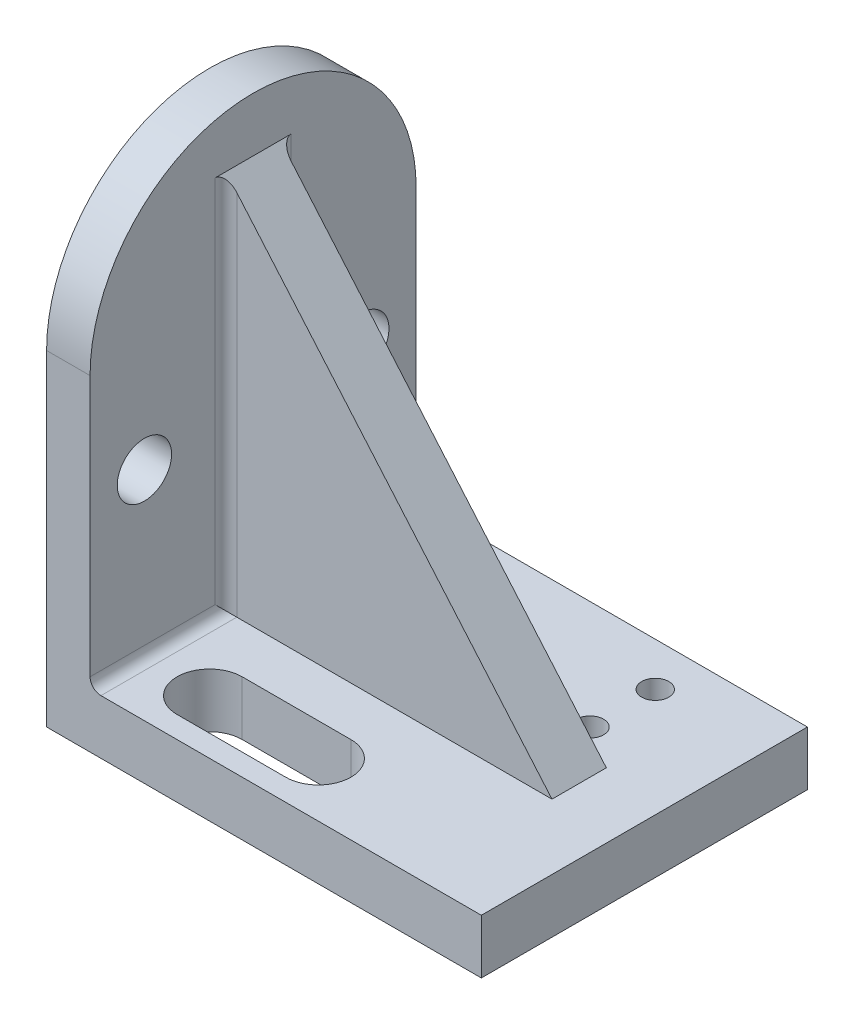
ISO-10303-21;
HEADER;
FILE_DESCRIPTION(('STEP AP214'),'2;1');
FILE_NAME('part.step','',(''),(''),'','','');
FILE_SCHEMA(('AUTOMOTIVE_DESIGN { 1 0 10303 214 1 1 1 1 }'));
ENDSEC;
DATA;
#1=APPLICATION_CONTEXT('core data for automotive mechanical design processes');
#2=APPLICATION_PROTOCOL_DEFINITION('international standard','automotive_design',2000,#1);
#3=PRODUCT_CONTEXT('',#1,'mechanical');
#4=PRODUCT('Part','Part','',(#3));
#5=PRODUCT_RELATED_PRODUCT_CATEGORY('part','',(#4));
#6=PRODUCT_DEFINITION_FORMATION('','',#4);
#7=PRODUCT_DEFINITION_CONTEXT('part definition',#1,'design');
#8=PRODUCT_DEFINITION('design','',#6,#7);
#9=PRODUCT_DEFINITION_SHAPE('','',#8);
#10=(LENGTH_UNIT() NAMED_UNIT(*) SI_UNIT(.MILLI.,.METRE.));
#11=(NAMED_UNIT(*) PLANE_ANGLE_UNIT() SI_UNIT($,.RADIAN.));
#12=(NAMED_UNIT(*) SI_UNIT($,.STERADIAN.) SOLID_ANGLE_UNIT());
#13=UNCERTAINTY_MEASURE_WITH_UNIT(LENGTH_MEASURE(1.E-05),#10,'distance_accuracy_value','');
#14=(GEOMETRIC_REPRESENTATION_CONTEXT(3) GLOBAL_UNCERTAINTY_ASSIGNED_CONTEXT((#13)) GLOBAL_UNIT_ASSIGNED_CONTEXT((#10,
#11,#12)) REPRESENTATION_CONTEXT('',''));
#15=CARTESIAN_POINT('',(0.,0.,0.));
#16=DIRECTION('',(0.,0.,1.));
#17=DIRECTION('',(1.,0.,0.));
#18=AXIS2_PLACEMENT_3D('',#15,#16,#17);
#19=CARTESIAN_POINT('',(-50.8,12.7,38.1));
#20=DIRECTION('',(1.,0.,0.));
#21=DIRECTION('',(0.,0.,-1.));
#22=AXIS2_PLACEMENT_3D('',#19,#20,#21);
#23=PLANE('',#22);
#24=DIRECTION('',(0.,0.,1.));
#25=VECTOR('',#24,1.);
#26=CARTESIAN_POINT('',(-50.8,0.,38.1));
#27=LINE('',#26,#25);
#28=CARTESIAN_POINT('',(-50.8,0.,-38.1));
#29=VERTEX_POINT('',#28);
#30=CARTESIAN_POINT('',(-50.8,0.,38.1));
#31=VERTEX_POINT('',#30);
#32=EDGE_CURVE('E261',#29,#31,#27,.T.);
#33=ORIENTED_EDGE('',*,*,#32,.T.);
#34=DIRECTION('',(0.,-1.,0.));
#35=VECTOR('',#34,1.);
#36=CARTESIAN_POINT('',(-50.8,12.7,38.1));
#37=LINE('',#36,#35);
#38=CARTESIAN_POINT('',(-50.8,76.2,38.1));
#39=VERTEX_POINT('',#38);
#40=EDGE_CURVE('E286',#39,#31,#37,.T.);
#41=ORIENTED_EDGE('',*,*,#40,.F.);
#42=CARTESIAN_POINT('',(-50.8,76.2,0.));
#43=DIRECTION('',(1.,0.,0.));
#44=DIRECTION('',(0.,0.,-1.));
#45=AXIS2_PLACEMENT_3D('',#42,#43,#44);
#46=CIRCLE('',#45,38.1);
#47=CARTESIAN_POINT('',(-50.8,76.2,-38.1));
#48=VERTEX_POINT('',#47);
#49=EDGE_CURVE('E219',#48,#39,#46,.T.);
#50=ORIENTED_EDGE('',*,*,#49,.F.);
#51=DIRECTION('',(0.,-1.,0.));
#52=VECTOR('',#51,1.);
#53=CARTESIAN_POINT('',(-50.8,12.7,-38.1));
#54=LINE('',#53,#52);
#55=EDGE_CURVE('E271',#48,#29,#54,.T.);
#56=ORIENTED_EDGE('',*,*,#55,.T.);
#57=EDGE_LOOP('',(#33,#41,#50,#56));
#58=FACE_BOUND('',#57,.T.);
#59=CARTESIAN_POINT('',(-50.8,50.8,25.4));
#60=DIRECTION('',(1.,0.,0.));
#61=DIRECTION('',(0.,0.,-1.));
#62=AXIS2_PLACEMENT_3D('',#59,#60,#61);
#63=CIRCLE('',#62,6.35);
#64=CARTESIAN_POINT('',(-50.8,50.8,19.05));
#65=VERTEX_POINT('',#64);
#66=EDGE_CURVE('E183',#65,#65,#63,.T.);
#67=ORIENTED_EDGE('',*,*,#66,.T.);
#68=EDGE_LOOP('',(#67));
#69=FACE_BOUND('',#68,.T.);
#70=CARTESIAN_POINT('',(-50.8,50.8,-25.4));
#71=DIRECTION('',(1.,0.,0.));
#72=DIRECTION('',(0.,0.,1.));
#73=AXIS2_PLACEMENT_3D('',#70,#71,#72);
#74=CIRCLE('',#73,6.35);
#75=CARTESIAN_POINT('',(-50.8,50.8,-19.05));
#76=VERTEX_POINT('',#75);
#77=EDGE_CURVE('E176',#76,#76,#74,.T.);
#78=ORIENTED_EDGE('',*,*,#77,.T.);
#79=EDGE_LOOP('',(#78));
#80=FACE_BOUND('',#79,.T.);
#81=ADVANCED_FACE('F37',(#58,#69,#80),#23,.F.);
#82=CARTESIAN_POINT('',(50.8,12.7,38.1));
#83=DIRECTION('',(0.,0.,-1.));
#84=DIRECTION('',(-1.,0.,0.));
#85=AXIS2_PLACEMENT_3D('',#82,#83,#84);
#86=PLANE('',#85);
#87=DIRECTION('',(1.,0.,0.));
#88=VECTOR('',#87,1.);
#89=CARTESIAN_POINT('',(50.8,12.7,38.1));
#90=LINE('',#89,#88);
#91=CARTESIAN_POINT('',(-38.1,12.7,38.1));
#92=VERTEX_POINT('',#91);
#93=CARTESIAN_POINT('',(50.8,12.7,38.1));
#94=VERTEX_POINT('',#93);
#95=EDGE_CURVE('E264',#92,#94,#90,.T.);
#96=ORIENTED_EDGE('',*,*,#95,.F.);
#97=CARTESIAN_POINT('',(-38.1,15.24,38.1));
#98=DIRECTION('',(0.,0.,-1.));
#99=DIRECTION('',(-1.,0.,0.));
#100=AXIS2_PLACEMENT_3D('',#97,#98,#99);
#101=CIRCLE('',#100,2.54);
#102=CARTESIAN_POINT('',(-40.64,15.24,38.1));
#103=VERTEX_POINT('',#102);
#104=EDGE_CURVE('E11',#92,#103,#101,.T.);
#105=ORIENTED_EDGE('',*,*,#104,.T.);
#106=DIRECTION('',(0.,1.,0.));
#107=VECTOR('',#106,1.);
#108=CARTESIAN_POINT('',(-40.64,0.,38.1));
#109=LINE('',#108,#107);
#110=CARTESIAN_POINT('',(-40.64,76.2,38.1));
#111=VERTEX_POINT('',#110);
#112=EDGE_CURVE('E248',#103,#111,#109,.T.);
#113=ORIENTED_EDGE('',*,*,#112,.T.);
#114=DIRECTION('',(-1.,0.,0.));
#115=VECTOR('',#114,1.);
#116=CARTESIAN_POINT('',(-40.64,76.2,38.1));
#117=LINE('',#116,#115);
#118=EDGE_CURVE('E255',#111,#39,#117,.T.);
#119=ORIENTED_EDGE('',*,*,#118,.T.);
#120=ORIENTED_EDGE('',*,*,#40,.T.);
#121=DIRECTION('',(1.,0.,0.));
#122=VECTOR('',#121,1.);
#123=CARTESIAN_POINT('',(50.8,0.,38.1));
#124=LINE('',#123,#122);
#125=CARTESIAN_POINT('',(50.8,0.,38.1));
#126=VERTEX_POINT('',#125);
#127=EDGE_CURVE('E273',#31,#126,#124,.T.);
#128=ORIENTED_EDGE('',*,*,#127,.T.);
#129=DIRECTION('',(0.,-1.,0.));
#130=VECTOR('',#129,1.);
#131=CARTESIAN_POINT('',(50.8,12.7,38.1));
#132=LINE('',#131,#130);
#133=EDGE_CURVE('E283',#94,#126,#132,.T.);
#134=ORIENTED_EDGE('',*,*,#133,.F.);
#135=EDGE_LOOP('',(#96,#105,#113,#119,#120,#128,#134));
#136=FACE_BOUND('',#135,.T.);
#137=ADVANCED_FACE('F339',(#136),#86,.F.);
#138=CARTESIAN_POINT('',(50.8,12.7,38.1));
#139=DIRECTION('',(-1.,0.,0.));
#140=DIRECTION('',(0.,0.,1.));
#141=AXIS2_PLACEMENT_3D('',#138,#139,#140);
#142=PLANE('',#141);
#143=DIRECTION('',(0.,0.,-1.));
#144=VECTOR('',#143,1.);
#145=CARTESIAN_POINT('',(50.8,0.,38.1));
#146=LINE('',#145,#144);
#147=CARTESIAN_POINT('',(50.8,0.,-38.1));
#148=VERTEX_POINT('',#147);
#149=EDGE_CURVE('E275',#126,#148,#146,.T.);
#150=ORIENTED_EDGE('',*,*,#149,.T.);
#151=DIRECTION('',(0.,-1.,0.));
#152=VECTOR('',#151,1.);
#153=CARTESIAN_POINT('',(50.8,12.7,-38.1));
#154=LINE('',#153,#152);
#155=CARTESIAN_POINT('',(50.8,12.7,-38.1));
#156=VERTEX_POINT('',#155);
#157=EDGE_CURVE('E280',#156,#148,#154,.T.);
#158=ORIENTED_EDGE('',*,*,#157,.F.);
#159=DIRECTION('',(0.,0.,-1.));
#160=VECTOR('',#159,1.);
#161=CARTESIAN_POINT('',(50.8,12.7,38.1));
#162=LINE('',#161,#160);
#163=EDGE_CURVE('E266',#94,#156,#162,.T.);
#164=ORIENTED_EDGE('',*,*,#163,.F.);
#165=ORIENTED_EDGE('',*,*,#133,.T.);
#166=EDGE_LOOP('',(#150,#158,#164,#165));
#167=FACE_BOUND('',#166,.T.);
#168=ADVANCED_FACE('F345',(#167),#142,.F.);
#169=CARTESIAN_POINT('',(50.8,12.7,-38.1));
#170=DIRECTION('',(0.,0.,1.));
#171=DIRECTION('',(1.,0.,0.));
#172=AXIS2_PLACEMENT_3D('',#169,#170,#171);
#173=PLANE('',#172);
#174=DIRECTION('',(-1.,0.,0.));
#175=VECTOR('',#174,1.);
#176=CARTESIAN_POINT('',(50.8,0.,-38.1));
#177=LINE('',#176,#175);
#178=EDGE_CURVE('E267',#148,#29,#177,.T.);
#179=ORIENTED_EDGE('',*,*,#178,.T.);
#180=ORIENTED_EDGE('',*,*,#55,.F.);
#181=DIRECTION('',(-1.,0.,0.));
#182=VECTOR('',#181,1.);
#183=CARTESIAN_POINT('',(-40.64,76.2,-38.1));
#184=LINE('',#183,#182);
#185=CARTESIAN_POINT('',(-40.64,76.2,-38.1));
#186=VERTEX_POINT('',#185);
#187=EDGE_CURVE('E258',#186,#48,#184,.T.);
#188=ORIENTED_EDGE('',*,*,#187,.F.);
#189=DIRECTION('',(0.,1.,0.));
#190=VECTOR('',#189,1.);
#191=CARTESIAN_POINT('',(-40.64,0.,-38.1));
#192=LINE('',#191,#190);
#193=CARTESIAN_POINT('',(-40.64,15.24,-38.1));
#194=VERTEX_POINT('',#193);
#195=EDGE_CURVE('E253',#194,#186,#192,.T.);
#196=ORIENTED_EDGE('',*,*,#195,.F.);
#197=CARTESIAN_POINT('',(-38.1,15.24,-38.1));
#198=DIRECTION('',(0.,0.,1.));
#199=DIRECTION('',(1.,0.,0.));
#200=AXIS2_PLACEMENT_3D('',#197,#198,#199);
#201=CIRCLE('',#200,2.54);
#202=CARTESIAN_POINT('',(-38.1,12.7,-38.1));
#203=VERTEX_POINT('',#202);
#204=EDGE_CURVE('E61',#194,#203,#201,.T.);
#205=ORIENTED_EDGE('',*,*,#204,.T.);
#206=DIRECTION('',(-1.,0.,0.));
#207=VECTOR('',#206,1.);
#208=CARTESIAN_POINT('',(50.8,12.7,-38.1));
#209=LINE('',#208,#207);
#210=EDGE_CURVE('E269',#156,#203,#209,.T.);
#211=ORIENTED_EDGE('',*,*,#210,.F.);
#212=ORIENTED_EDGE('',*,*,#157,.T.);
#213=EDGE_LOOP('',(#179,#180,#188,#196,#205,#211,#212));
#214=FACE_BOUND('',#213,.T.);
#215=ADVANCED_FACE('F416',(#214),#173,.F.);
#216=CARTESIAN_POINT('',(0.,12.7,0.));
#217=DIRECTION('',(0.,1.,0.));
#218=DIRECTION('',(0.,0.,1.));
#219=AXIS2_PLACEMENT_3D('',#216,#217,#218);
#220=PLANE('',#219);
#221=ORIENTED_EDGE('',*,*,#210,.T.);
#222=DIRECTION('',(0.,0.,-1.));
#223=VECTOR('',#222,1.);
#224=CARTESIAN_POINT('',(-38.1,12.7,-6.35));
#225=LINE('',#224,#223);
#226=CARTESIAN_POINT('',(-38.1,12.7,-6.35));
#227=VERTEX_POINT('',#226);
#228=EDGE_CURVE('E171',#203,#227,#225,.F.);
#229=ORIENTED_EDGE('',*,*,#228,.T.);
#230=DIRECTION('',(1.,0.,0.));
#231=VECTOR('',#230,1.);
#232=CARTESIAN_POINT('',(0.,12.7,-6.35));
#233=LINE('',#232,#231);
#234=CARTESIAN_POINT('',(35.56,12.7,-6.35));
#235=VERTEX_POINT('',#234);
#236=EDGE_CURVE('E155',#227,#235,#233,.T.);
#237=ORIENTED_EDGE('',*,*,#236,.T.);
#238=DIRECTION('',(0.,0.,1.));
#239=VECTOR('',#238,1.);
#240=CARTESIAN_POINT('',(35.56,12.7,0.));
#241=LINE('',#240,#239);
#242=CARTESIAN_POINT('',(35.56,12.7,6.35));
#243=VERTEX_POINT('',#242);
#244=EDGE_CURVE('E169',#243,#235,#241,.F.);
#245=ORIENTED_EDGE('',*,*,#244,.F.);
#246=DIRECTION('',(1.,0.,0.));
#247=VECTOR('',#246,1.);
#248=CARTESIAN_POINT('',(0.,12.7,6.35));
#249=LINE('',#248,#247);
#250=CARTESIAN_POINT('',(-38.1,12.7,6.35));
#251=VERTEX_POINT('',#250);
#252=EDGE_CURVE('E172',#251,#243,#249,.T.);
#253=ORIENTED_EDGE('',*,*,#252,.F.);
#254=DIRECTION('',(0.,0.,-1.));
#255=VECTOR('',#254,1.);
#256=CARTESIAN_POINT('',(-38.1,12.7,38.1));
#257=LINE('',#256,#255);
#258=EDGE_CURVE('E302',#251,#92,#257,.F.);
#259=ORIENTED_EDGE('',*,*,#258,.T.);
#260=ORIENTED_EDGE('',*,*,#95,.T.);
#261=ORIENTED_EDGE('',*,*,#163,.T.);
#262=EDGE_LOOP('',(#221,#229,#237,#245,#253,#259,#260,#261));
#263=FACE_BOUND('',#262,.T.);
#264=CARTESIAN_POINT('',(-25.4,12.7,25.4));
#265=DIRECTION('',(0.,1.,0.));
#266=DIRECTION('',(0.,0.,1.));
#267=AXIS2_PLACEMENT_3D('',#264,#265,#266);
#268=CIRCLE('',#267,7.62);
#269=CARTESIAN_POINT('',(-25.4,12.7,17.78));
#270=VERTEX_POINT('',#269);
#271=CARTESIAN_POINT('',(-25.4,12.7,33.02));
#272=VERTEX_POINT('',#271);
#273=EDGE_CURVE('E206',#270,#272,#268,.T.);
#274=ORIENTED_EDGE('',*,*,#273,.F.);
#275=DIRECTION('',(-1.,0.,0.));
#276=VECTOR('',#275,1.);
#277=CARTESIAN_POINT('',(-25.4,12.7,17.78));
#278=LINE('',#277,#276);
#279=CARTESIAN_POINT('',(0.,12.7,17.78));
#280=VERTEX_POINT('',#279);
#281=EDGE_CURVE('E196',#280,#270,#278,.T.);
#282=ORIENTED_EDGE('',*,*,#281,.F.);
#283=CARTESIAN_POINT('',(0.,12.7,25.4));
#284=DIRECTION('',(0.,1.,0.));
#285=DIRECTION('',(0.,0.,1.));
#286=AXIS2_PLACEMENT_3D('',#283,#284,#285);
#287=CIRCLE('',#286,7.62);
#288=CARTESIAN_POINT('',(0.,12.7,33.02));
#289=VERTEX_POINT('',#288);
#290=EDGE_CURVE('E212',#289,#280,#287,.T.);
#291=ORIENTED_EDGE('',*,*,#290,.F.);
#292=DIRECTION('',(1.,0.,0.));
#293=VECTOR('',#292,1.);
#294=CARTESIAN_POINT('',(-25.4,12.7,33.02));
#295=LINE('',#294,#293);
#296=EDGE_CURVE('E208',#272,#289,#295,.T.);
#297=ORIENTED_EDGE('',*,*,#296,.F.);
#298=EDGE_LOOP('',(#274,#282,#291,#297));
#299=FACE_BOUND('',#298,.T.);
#300=CARTESIAN_POINT('',(-25.4,12.7,-27.94));
#301=DIRECTION('',(0.,1.,0.));
#302=DIRECTION('',(0.,0.,1.));
#303=AXIS2_PLACEMENT_3D('',#300,#301,#302);
#304=CIRCLE('',#303,3.175);
#305=CARTESIAN_POINT('',(-25.4,12.7,-24.765));
#306=VERTEX_POINT('',#305);
#307=EDGE_CURVE('E228',#306,#306,#304,.T.);
#308=ORIENTED_EDGE('',*,*,#307,.F.);
#309=EDGE_LOOP('',(#308));
#310=FACE_BOUND('',#309,.T.);
#311=CARTESIAN_POINT('',(25.4,12.7,-27.94));
#312=DIRECTION('',(0.,1.,0.));
#313=DIRECTION('',(0.,0.,1.));
#314=AXIS2_PLACEMENT_3D('',#311,#312,#313);
#315=CIRCLE('',#314,3.175);
#316=CARTESIAN_POINT('',(25.4,12.7,-24.765));
#317=VERTEX_POINT('',#316);
#318=EDGE_CURVE('E234',#317,#317,#315,.T.);
#319=ORIENTED_EDGE('',*,*,#318,.F.);
#320=EDGE_LOOP('',(#319));
#321=FACE_BOUND('',#320,.T.);
#322=CARTESIAN_POINT('',(25.4,12.7,-12.7));
#323=DIRECTION('',(0.,1.,0.));
#324=DIRECTION('',(0.,0.,1.));
#325=AXIS2_PLACEMENT_3D('',#322,#323,#324);
#326=CIRCLE('',#325,3.175);
#327=CARTESIAN_POINT('',(25.4,12.7,-9.52500000000001));
#328=VERTEX_POINT('',#327);
#329=EDGE_CURVE('E240',#328,#328,#326,.T.);
#330=ORIENTED_EDGE('',*,*,#329,.F.);
#331=EDGE_LOOP('',(#330));
#332=FACE_BOUND('',#331,.T.);
#333=CARTESIAN_POINT('',(-25.4,12.7,-12.7));
#334=DIRECTION('',(0.,1.,0.));
#335=DIRECTION('',(0.,0.,1.));
#336=AXIS2_PLACEMENT_3D('',#333,#334,#335);
#337=CIRCLE('',#336,3.175);
#338=CARTESIAN_POINT('',(-25.4,12.7,-9.52500000000001));
#339=VERTEX_POINT('',#338);
#340=EDGE_CURVE('E186',#339,#339,#337,.T.);
#341=ORIENTED_EDGE('',*,*,#340,.F.);
#342=EDGE_LOOP('',(#341));
#343=FACE_BOUND('',#342,.T.);
#344=ADVANCED_FACE('F166',(#263,#299,#310,#321,#332,#343),#220,.T.);
#345=CARTESIAN_POINT('',(0.,0.,0.));
#346=DIRECTION('',(0.,1.,0.));
#347=DIRECTION('',(0.,0.,1.));
#348=AXIS2_PLACEMENT_3D('',#345,#346,#347);
#349=PLANE('',#348);
#350=DIRECTION('',(-1.,0.,0.));
#351=VECTOR('',#350,1.);
#352=CARTESIAN_POINT('',(-25.4,0.,17.78));
#353=LINE('',#352,#351);
#354=CARTESIAN_POINT('',(0.,0.,17.78));
#355=VERTEX_POINT('',#354);
#356=CARTESIAN_POINT('',(-25.4,0.,17.78));
#357=VERTEX_POINT('',#356);
#358=EDGE_CURVE('E202',#355,#357,#353,.T.);
#359=ORIENTED_EDGE('',*,*,#358,.T.);
#360=CARTESIAN_POINT('',(-25.4,0.,25.4));
#361=DIRECTION('',(0.,1.,0.));
#362=DIRECTION('',(0.,0.,1.));
#363=AXIS2_PLACEMENT_3D('',#360,#361,#362);
#364=CIRCLE('',#363,7.62);
#365=CARTESIAN_POINT('',(-25.4,0.,33.02));
#366=VERTEX_POINT('',#365);
#367=EDGE_CURVE('E192',#357,#366,#364,.T.);
#368=ORIENTED_EDGE('',*,*,#367,.T.);
#369=DIRECTION('',(1.,0.,0.));
#370=VECTOR('',#369,1.);
#371=CARTESIAN_POINT('',(-25.4,0.,33.02));
#372=LINE('',#371,#370);
#373=CARTESIAN_POINT('',(0.,0.,33.02));
#374=VERTEX_POINT('',#373);
#375=EDGE_CURVE('E195',#366,#374,#372,.T.);
#376=ORIENTED_EDGE('',*,*,#375,.T.);
#377=CARTESIAN_POINT('',(0.,0.,25.4));
#378=DIRECTION('',(0.,1.,0.));
#379=DIRECTION('',(0.,0.,1.));
#380=AXIS2_PLACEMENT_3D('',#377,#378,#379);
#381=CIRCLE('',#380,7.62);
#382=EDGE_CURVE('E199',#374,#355,#381,.T.);
#383=ORIENTED_EDGE('',*,*,#382,.T.);
#384=EDGE_LOOP('',(#359,#368,#376,#383));
#385=FACE_BOUND('',#384,.T.);
#386=CARTESIAN_POINT('',(-25.4,0.,-27.94));
#387=DIRECTION('',(0.,1.,0.));
#388=DIRECTION('',(0.,0.,1.));
#389=AXIS2_PLACEMENT_3D('',#386,#387,#388);
#390=CIRCLE('',#389,3.175);
#391=CARTESIAN_POINT('',(-25.4,0.,-24.765));
#392=VERTEX_POINT('',#391);
#393=EDGE_CURVE('E209',#392,#392,#390,.T.);
#394=ORIENTED_EDGE('',*,*,#393,.T.);
#395=EDGE_LOOP('',(#394));
#396=FACE_BOUND('',#395,.T.);
#397=CARTESIAN_POINT('',(25.4,0.,-27.94));
#398=DIRECTION('',(0.,1.,0.));
#399=DIRECTION('',(0.,0.,1.));
#400=AXIS2_PLACEMENT_3D('',#397,#398,#399);
#401=CIRCLE('',#400,3.175);
#402=CARTESIAN_POINT('',(25.4,0.,-24.765));
#403=VERTEX_POINT('',#402);
#404=EDGE_CURVE('E231',#403,#403,#401,.T.);
#405=ORIENTED_EDGE('',*,*,#404,.T.);
#406=EDGE_LOOP('',(#405));
#407=FACE_BOUND('',#406,.T.);
#408=CARTESIAN_POINT('',(25.4,0.,-12.7));
#409=DIRECTION('',(0.,1.,0.));
#410=DIRECTION('',(0.,0.,1.));
#411=AXIS2_PLACEMENT_3D('',#408,#409,#410);
#412=CIRCLE('',#411,3.175);
#413=CARTESIAN_POINT('',(25.4,0.,-9.52500000000001));
#414=VERTEX_POINT('',#413);
#415=EDGE_CURVE('E237',#414,#414,#412,.T.);
#416=ORIENTED_EDGE('',*,*,#415,.T.);
#417=EDGE_LOOP('',(#416));
#418=FACE_BOUND('',#417,.T.);
#419=CARTESIAN_POINT('',(-25.4,0.,-12.7));
#420=DIRECTION('',(0.,1.,0.));
#421=DIRECTION('',(0.,0.,1.));
#422=AXIS2_PLACEMENT_3D('',#419,#420,#421);
#423=CIRCLE('',#422,3.175);
#424=CARTESIAN_POINT('',(-25.4,0.,-9.52500000000001));
#425=VERTEX_POINT('',#424);
#426=EDGE_CURVE('E243',#425,#425,#423,.T.);
#427=ORIENTED_EDGE('',*,*,#426,.T.);
#428=EDGE_LOOP('',(#427));
#429=FACE_BOUND('',#428,.T.);
#430=ORIENTED_EDGE('',*,*,#127,.F.);
#431=ORIENTED_EDGE('',*,*,#32,.F.);
#432=ORIENTED_EDGE('',*,*,#178,.F.);
#433=ORIENTED_EDGE('',*,*,#149,.F.);
#434=EDGE_LOOP('',(#430,#431,#432,#433));
#435=FACE_BOUND('',#434,.T.);
#436=ADVANCED_FACE('F415',(#385,#396,#407,#418,#429,#435),#349,.F.);
#437=CARTESIAN_POINT('',(-40.64,76.2,0.));
#438=DIRECTION('',(-1.,0.,0.));
#439=DIRECTION('',(0.,0.,1.));
#440=AXIS2_PLACEMENT_3D('',#437,#438,#439);
#441=CYLINDRICAL_SURFACE('',#440,38.1);
#442=ORIENTED_EDGE('',*,*,#49,.T.);
#443=ORIENTED_EDGE('',*,*,#118,.F.);
#444=CARTESIAN_POINT('',(-40.64,76.2,0.));
#445=DIRECTION('',(1.,0.,0.));
#446=DIRECTION('',(0.,0.,-1.));
#447=AXIS2_PLACEMENT_3D('',#444,#445,#446);
#448=CIRCLE('',#447,38.1);
#449=EDGE_CURVE('E250',#186,#111,#448,.T.);
#450=ORIENTED_EDGE('',*,*,#449,.F.);
#451=ORIENTED_EDGE('',*,*,#187,.T.);
#452=EDGE_LOOP('',(#442,#443,#450,#451));
#453=FACE_BOUND('',#452,.T.);
#454=ADVANCED_FACE('F400',(#453),#441,.T.);
#455=CARTESIAN_POINT('',(-40.64,76.2,0.));
#456=DIRECTION('',(1.,0.,0.));
#457=DIRECTION('',(0.,0.,-1.));
#458=AXIS2_PLACEMENT_3D('',#455,#456,#457);
#459=PLANE('',#458);
#460=DIRECTION('',(0.,0.,-1.));
#461=VECTOR('',#460,1.);
#462=CARTESIAN_POINT('',(-40.64,101.6,0.));
#463=LINE('',#462,#461);
#464=CARTESIAN_POINT('',(-40.64,101.6,-8.89));
#465=VERTEX_POINT('',#464);
#466=CARTESIAN_POINT('',(-40.64,101.6,8.89));
#467=VERTEX_POINT('',#466);
#468=EDGE_CURVE('E289',#465,#467,#463,.F.);
#469=ORIENTED_EDGE('',*,*,#468,.F.);
#470=DIRECTION('',(0.,-1.,0.));
#471=VECTOR('',#470,1.);
#472=CARTESIAN_POINT('',(-40.64,76.2,-8.89));
#473=LINE('',#472,#471);
#474=CARTESIAN_POINT('',(-40.64,15.24,-8.89));
#475=VERTEX_POINT('',#474);
#476=EDGE_CURVE('E298',#465,#475,#473,.T.);
#477=ORIENTED_EDGE('',*,*,#476,.T.);
#478=DIRECTION('',(0.,0.,-1.));
#479=VECTOR('',#478,1.);
#480=CARTESIAN_POINT('',(-40.64,15.24,-38.1));
#481=LINE('',#480,#479);
#482=EDGE_CURVE('E296',#475,#194,#481,.T.);
#483=ORIENTED_EDGE('',*,*,#482,.T.);
#484=ORIENTED_EDGE('',*,*,#195,.T.);
#485=ORIENTED_EDGE('',*,*,#449,.T.);
#486=ORIENTED_EDGE('',*,*,#112,.F.);
#487=DIRECTION('',(0.,0.,-1.));
#488=VECTOR('',#487,1.);
#489=CARTESIAN_POINT('',(-40.64,15.24,6.35));
#490=LINE('',#489,#488);
#491=CARTESIAN_POINT('',(-40.64,15.24,8.89));
#492=VERTEX_POINT('',#491);
#493=EDGE_CURVE('E291',#103,#492,#490,.T.);
#494=ORIENTED_EDGE('',*,*,#493,.T.);
#495=DIRECTION('',(0.,-1.,0.));
#496=VECTOR('',#495,1.);
#497=CARTESIAN_POINT('',(-40.64,101.6,8.89));
#498=LINE('',#497,#496);
#499=EDGE_CURVE('E293',#492,#467,#498,.F.);
#500=ORIENTED_EDGE('',*,*,#499,.T.);
#501=EDGE_LOOP('',(#469,#477,#483,#484,#485,#486,#494,#500));
#502=FACE_BOUND('',#501,.T.);
#503=CARTESIAN_POINT('',(-40.64,50.8,25.4));
#504=DIRECTION('',(1.,0.,0.));
#505=DIRECTION('',(0.,0.,-1.));
#506=AXIS2_PLACEMENT_3D('',#503,#504,#505);
#507=CIRCLE('',#506,6.35);
#508=CARTESIAN_POINT('',(-40.64,50.8,19.05));
#509=VERTEX_POINT('',#508);
#510=EDGE_CURVE('E187',#509,#509,#507,.T.);
#511=ORIENTED_EDGE('',*,*,#510,.F.);
#512=EDGE_LOOP('',(#511));
#513=FACE_BOUND('',#512,.T.);
#514=CARTESIAN_POINT('',(-40.64,50.8,-25.4));
#515=DIRECTION('',(1.,0.,0.));
#516=DIRECTION('',(0.,0.,1.));
#517=AXIS2_PLACEMENT_3D('',#514,#515,#516);
#518=CIRCLE('',#517,6.35);
#519=CARTESIAN_POINT('',(-40.64,50.8,-19.05));
#520=VERTEX_POINT('',#519);
#521=EDGE_CURVE('E179',#520,#520,#518,.T.);
#522=ORIENTED_EDGE('',*,*,#521,.F.);
#523=EDGE_LOOP('',(#522));
#524=FACE_BOUND('',#523,.T.);
#525=ADVANCED_FACE('F394',(#502,#513,#524),#459,.T.);
#526=CARTESIAN_POINT('',(-25.4,0.,-12.7));
#527=DIRECTION('',(0.,1.,0.));
#528=DIRECTION('',(0.,0.,1.));
#529=AXIS2_PLACEMENT_3D('',#526,#527,#528);
#530=CYLINDRICAL_SURFACE('',#529,3.175);
#531=ORIENTED_EDGE('',*,*,#426,.F.);
#532=EDGE_LOOP('',(#531));
#533=FACE_BOUND('',#532,.T.);
#534=ORIENTED_EDGE('',*,*,#340,.T.);
#535=EDGE_LOOP('',(#534));
#536=FACE_BOUND('',#535,.T.);
#537=ADVANCED_FACE('F399',(#533,#536),#530,.F.);
#538=CARTESIAN_POINT('',(25.4,0.,-12.7));
#539=DIRECTION('',(0.,1.,0.));
#540=DIRECTION('',(0.,0.,1.));
#541=AXIS2_PLACEMENT_3D('',#538,#539,#540);
#542=CYLINDRICAL_SURFACE('',#541,3.175);
#543=ORIENTED_EDGE('',*,*,#415,.F.);
#544=EDGE_LOOP('',(#543));
#545=FACE_BOUND('',#544,.T.);
#546=ORIENTED_EDGE('',*,*,#329,.T.);
#547=EDGE_LOOP('',(#546));
#548=FACE_BOUND('',#547,.T.);
#549=ADVANCED_FACE('F533',(#545,#548),#542,.F.);
#550=CARTESIAN_POINT('',(25.4,0.,-27.94));
#551=DIRECTION('',(0.,1.,0.));
#552=DIRECTION('',(0.,0.,1.));
#553=AXIS2_PLACEMENT_3D('',#550,#551,#552);
#554=CYLINDRICAL_SURFACE('',#553,3.175);
#555=ORIENTED_EDGE('',*,*,#404,.F.);
#556=EDGE_LOOP('',(#555));
#557=FACE_BOUND('',#556,.T.);
#558=ORIENTED_EDGE('',*,*,#318,.T.);
#559=EDGE_LOOP('',(#558));
#560=FACE_BOUND('',#559,.T.);
#561=ADVANCED_FACE('F522',(#557,#560),#554,.F.);
#562=CARTESIAN_POINT('',(-25.4,0.,-27.94));
#563=DIRECTION('',(0.,1.,0.));
#564=DIRECTION('',(0.,0.,1.));
#565=AXIS2_PLACEMENT_3D('',#562,#563,#564);
#566=CYLINDRICAL_SURFACE('',#565,3.175);
#567=ORIENTED_EDGE('',*,*,#393,.F.);
#568=EDGE_LOOP('',(#567));
#569=FACE_BOUND('',#568,.T.);
#570=ORIENTED_EDGE('',*,*,#307,.T.);
#571=EDGE_LOOP('',(#570));
#572=FACE_BOUND('',#571,.T.);
#573=ADVANCED_FACE('F511',(#569,#572),#566,.F.);
#574=CARTESIAN_POINT('',(-25.4,0.,25.4));
#575=DIRECTION('',(0.,1.,0.));
#576=DIRECTION('',(0.,0.,1.));
#577=AXIS2_PLACEMENT_3D('',#574,#575,#576);
#578=CYLINDRICAL_SURFACE('',#577,7.62);
#579=ORIENTED_EDGE('',*,*,#273,.T.);
#580=DIRECTION('',(0.,1.,0.));
#581=VECTOR('',#580,1.);
#582=CARTESIAN_POINT('',(-25.4,0.,33.02));
#583=LINE('',#582,#581);
#584=EDGE_CURVE('E205',#366,#272,#583,.T.);
#585=ORIENTED_EDGE('',*,*,#584,.F.);
#586=ORIENTED_EDGE('',*,*,#367,.F.);
#587=DIRECTION('',(0.,1.,0.));
#588=VECTOR('',#587,1.);
#589=CARTESIAN_POINT('',(-25.4,0.,17.78));
#590=LINE('',#589,#588);
#591=EDGE_CURVE('E217',#357,#270,#590,.T.);
#592=ORIENTED_EDGE('',*,*,#591,.T.);
#593=EDGE_LOOP('',(#579,#585,#586,#592));
#594=FACE_BOUND('',#593,.T.);
#595=ADVANCED_FACE('F500',(#594),#578,.F.);
#596=CARTESIAN_POINT('',(-25.4,0.,17.78));
#597=DIRECTION('',(0.,0.,-1.));
#598=DIRECTION('',(-1.,0.,0.));
#599=AXIS2_PLACEMENT_3D('',#596,#597,#598);
#600=PLANE('',#599);
#601=ORIENTED_EDGE('',*,*,#281,.T.);
#602=ORIENTED_EDGE('',*,*,#591,.F.);
#603=ORIENTED_EDGE('',*,*,#358,.F.);
#604=DIRECTION('',(0.,1.,0.));
#605=VECTOR('',#604,1.);
#606=CARTESIAN_POINT('',(0.,0.,17.78));
#607=LINE('',#606,#605);
#608=EDGE_CURVE('E220',#355,#280,#607,.T.);
#609=ORIENTED_EDGE('',*,*,#608,.T.);
#610=EDGE_LOOP('',(#601,#602,#603,#609));
#611=FACE_BOUND('',#610,.T.);
#612=ADVANCED_FACE('F489',(#611),#600,.F.);
#613=CARTESIAN_POINT('',(0.,0.,25.4));
#614=DIRECTION('',(0.,1.,0.));
#615=DIRECTION('',(0.,0.,1.));
#616=AXIS2_PLACEMENT_3D('',#613,#614,#615);
#617=CYLINDRICAL_SURFACE('',#616,7.62);
#618=ORIENTED_EDGE('',*,*,#290,.T.);
#619=ORIENTED_EDGE('',*,*,#608,.F.);
#620=ORIENTED_EDGE('',*,*,#382,.F.);
#621=DIRECTION('',(0.,1.,0.));
#622=VECTOR('',#621,1.);
#623=CARTESIAN_POINT('',(0.,0.,33.02));
#624=LINE('',#623,#622);
#625=EDGE_CURVE('E222',#374,#289,#624,.T.);
#626=ORIENTED_EDGE('',*,*,#625,.T.);
#627=EDGE_LOOP('',(#618,#619,#620,#626));
#628=FACE_BOUND('',#627,.T.);
#629=ADVANCED_FACE('F478',(#628),#617,.F.);
#630=CARTESIAN_POINT('',(-25.4,0.,33.02));
#631=DIRECTION('',(0.,0.,1.));
#632=DIRECTION('',(1.,0.,0.));
#633=AXIS2_PLACEMENT_3D('',#630,#631,#632);
#634=PLANE('',#633);
#635=ORIENTED_EDGE('',*,*,#296,.T.);
#636=ORIENTED_EDGE('',*,*,#625,.F.);
#637=ORIENTED_EDGE('',*,*,#375,.F.);
#638=ORIENTED_EDGE('',*,*,#584,.T.);
#639=EDGE_LOOP('',(#635,#636,#637,#638));
#640=FACE_BOUND('',#639,.T.);
#641=ADVANCED_FACE('F467',(#640),#634,.F.);
#642=CARTESIAN_POINT('',(-50.8,50.8,-25.4));
#643=DIRECTION('',(1.,0.,0.));
#644=DIRECTION('',(0.,0.,-1.));
#645=AXIS2_PLACEMENT_3D('',#642,#643,#644);
#646=CYLINDRICAL_SURFACE('',#645,6.35);
#647=ORIENTED_EDGE('',*,*,#77,.F.);
#648=EDGE_LOOP('',(#647));
#649=FACE_BOUND('',#648,.T.);
#650=ORIENTED_EDGE('',*,*,#521,.T.);
#651=EDGE_LOOP('',(#650));
#652=FACE_BOUND('',#651,.T.);
#653=ADVANCED_FACE('F456',(#649,#652),#646,.F.);
#654=CARTESIAN_POINT('',(-50.8,50.8,25.4));
#655=DIRECTION('',(1.,0.,0.));
#656=DIRECTION('',(0.,0.,-1.));
#657=AXIS2_PLACEMENT_3D('',#654,#655,#656);
#658=CYLINDRICAL_SURFACE('',#657,6.35);
#659=ORIENTED_EDGE('',*,*,#66,.F.);
#660=EDGE_LOOP('',(#659));
#661=FACE_BOUND('',#660,.T.);
#662=ORIENTED_EDGE('',*,*,#510,.T.);
#663=EDGE_LOOP('',(#662));
#664=FACE_BOUND('',#663,.T.);
#665=ADVANCED_FACE('F336',(#661,#664),#658,.F.);
#666=CARTESIAN_POINT('',(-40.64,101.6,0.));
#667=DIRECTION('',(-0.759256602365297,-0.650791373455969,0.));
#668=DIRECTION('',(0.650791373455969,-0.759256602365297,0.));
#669=AXIS2_PLACEMENT_3D('',#666,#667,#668);
#670=PLANE('',#669);
#671=ORIENTED_EDGE('',*,*,#468,.T.);
#672=CARTESIAN_POINT('',(-38.1,98.6366666666667,8.89));
#673=DIRECTION('',(-0.759256602365297,-0.650791373455969,0.));
#674=DIRECTION('',(-0.650791373455969,0.759256602365297,0.));
#675=AXIS2_PLACEMENT_3D('',#672,#673,#674);
#676=ELLIPSE('',#675,3.90294048692066,2.54);
#677=CARTESIAN_POINT('',(-38.1,98.6366666666667,6.35));
#678=VERTEX_POINT('',#677);
#679=EDGE_CURVE('E46',#467,#678,#676,.T.);
#680=ORIENTED_EDGE('',*,*,#679,.T.);
#681=DIRECTION('',(0.650791373455969,-0.759256602365297,0.));
#682=VECTOR('',#681,1.);
#683=CARTESIAN_POINT('',(-40.64,101.6,6.35));
#684=LINE('',#683,#682);
#685=EDGE_CURVE('E161',#678,#243,#684,.T.);
#686=ORIENTED_EDGE('',*,*,#685,.T.);
#687=ORIENTED_EDGE('',*,*,#244,.T.);
#688=DIRECTION('',(0.650791373455969,-0.759256602365297,0.));
#689=VECTOR('',#688,1.);
#690=CARTESIAN_POINT('',(-40.64,101.6,-6.35));
#691=LINE('',#690,#689);
#692=CARTESIAN_POINT('',(-38.1,98.6366666666667,-6.35));
#693=VERTEX_POINT('',#692);
#694=EDGE_CURVE('E152',#693,#235,#691,.T.);
#695=ORIENTED_EDGE('',*,*,#694,.F.);
#696=CARTESIAN_POINT('',(-38.1,98.6366666666667,-8.89));
#697=DIRECTION('',(-0.759256602365297,-0.650791373455969,0.));
#698=DIRECTION('',(0.650791373455969,-0.759256602365297,0.));
#699=AXIS2_PLACEMENT_3D('',#696,#697,#698);
#700=ELLIPSE('',#699,3.90294048692066,2.54);
#701=EDGE_CURVE('E308',#693,#465,#700,.T.);
#702=ORIENTED_EDGE('',*,*,#701,.T.);
#703=EDGE_LOOP('',(#671,#680,#686,#687,#695,#702));
#704=FACE_BOUND('',#703,.T.);
#705=ADVANCED_FACE('F174',(#704),#670,.F.);
#706=CARTESIAN_POINT('',(0.,57.15,6.35));
#707=DIRECTION('',(0.,0.,1.));
#708=DIRECTION('',(1.,0.,0.));
#709=AXIS2_PLACEMENT_3D('',#706,#707,#708);
#710=PLANE('',#709);
#711=ORIENTED_EDGE('',*,*,#685,.F.);
#712=DIRECTION('',(0.,-1.,0.));
#713=VECTOR('',#712,1.);
#714=CARTESIAN_POINT('',(-38.1,12.7,6.35));
#715=LINE('',#714,#713);
#716=EDGE_CURVE('E305',#678,#251,#715,.T.);
#717=ORIENTED_EDGE('',*,*,#716,.T.);
#718=ORIENTED_EDGE('',*,*,#252,.T.);
#719=EDGE_LOOP('',(#711,#717,#718));
#720=FACE_BOUND('',#719,.T.);
#721=ADVANCED_FACE('F326',(#720),#710,.T.);
#722=CARTESIAN_POINT('',(0.,57.15,-6.35));
#723=DIRECTION('',(0.,0.,1.));
#724=DIRECTION('',(1.,0.,0.));
#725=AXIS2_PLACEMENT_3D('',#722,#723,#724);
#726=PLANE('',#725);
#727=ORIENTED_EDGE('',*,*,#236,.F.);
#728=DIRECTION('',(0.,-1.,0.));
#729=VECTOR('',#728,1.);
#730=CARTESIAN_POINT('',(-38.1,57.15,-6.35));
#731=LINE('',#730,#729);
#732=EDGE_CURVE('E157',#227,#693,#731,.F.);
#733=ORIENTED_EDGE('',*,*,#732,.T.);
#734=ORIENTED_EDGE('',*,*,#694,.T.);
#735=EDGE_LOOP('',(#727,#733,#734));
#736=FACE_BOUND('',#735,.T.);
#737=ADVANCED_FACE('F154',(#736),#726,.F.);
#738=CARTESIAN_POINT('',(-38.1,15.24,0.));
#739=DIRECTION('',(0.,0.,1.));
#740=DIRECTION('',(1.,0.,0.));
#741=AXIS2_PLACEMENT_3D('',#738,#739,#740);
#742=CYLINDRICAL_SURFACE('',#741,2.54);
#743=ORIENTED_EDGE('',*,*,#204,.F.);
#744=ORIENTED_EDGE('',*,*,#482,.F.);
#745=CARTESIAN_POINT('',(-38.1,15.24,-8.89));
#746=DIRECTION('',(0.,-0.707106781186547,-0.707106781186547));
#747=DIRECTION('',(0.,-0.707106781186547,0.707106781186547));
#748=AXIS2_PLACEMENT_3D('',#745,#746,#747);
#749=ELLIPSE('',#748,3.59210244842766,2.54);
#750=EDGE_CURVE('E162',#227,#475,#749,.T.);
#751=ORIENTED_EDGE('',*,*,#750,.F.);
#752=ORIENTED_EDGE('',*,*,#228,.F.);
#753=EDGE_LOOP('',(#743,#744,#751,#752));
#754=FACE_BOUND('',#753,.T.);
#755=ADVANCED_FACE('F334',(#754),#742,.F.);
#756=CARTESIAN_POINT('',(-38.1,76.2,-8.89));
#757=DIRECTION('',(0.,-1.,0.));
#758=DIRECTION('',(0.,0.,-1.));
#759=AXIS2_PLACEMENT_3D('',#756,#757,#758);
#760=CYLINDRICAL_SURFACE('',#759,2.54);
#761=ORIENTED_EDGE('',*,*,#701,.F.);
#762=ORIENTED_EDGE('',*,*,#732,.F.);
#763=ORIENTED_EDGE('',*,*,#750,.T.);
#764=ORIENTED_EDGE('',*,*,#476,.F.);
#765=EDGE_LOOP('',(#761,#762,#763,#764));
#766=FACE_BOUND('',#765,.T.);
#767=ADVANCED_FACE('F351',(#766),#760,.F.);
#768=CARTESIAN_POINT('',(-38.1,15.24,0.));
#769=DIRECTION('',(0.,0.,1.));
#770=DIRECTION('',(1.,0.,0.));
#771=AXIS2_PLACEMENT_3D('',#768,#769,#770);
#772=CYLINDRICAL_SURFACE('',#771,2.54);
#773=ORIENTED_EDGE('',*,*,#104,.F.);
#774=ORIENTED_EDGE('',*,*,#258,.F.);
#775=CARTESIAN_POINT('',(-38.1,15.24,8.89));
#776=DIRECTION('',(0.,0.707106781186547,-0.707106781186547));
#777=DIRECTION('',(0.,0.707106781186547,0.707106781186547));
#778=AXIS2_PLACEMENT_3D('',#775,#776,#777);
#779=ELLIPSE('',#778,3.59210244842766,2.54);
#780=EDGE_CURVE('E41',#492,#251,#779,.F.);
#781=ORIENTED_EDGE('',*,*,#780,.F.);
#782=ORIENTED_EDGE('',*,*,#493,.F.);
#783=EDGE_LOOP('',(#773,#774,#781,#782));
#784=FACE_BOUND('',#783,.T.);
#785=ADVANCED_FACE('F39',(#784),#772,.F.);
#786=CARTESIAN_POINT('',(-38.1,57.15,8.89));
#787=DIRECTION('',(0.,1.,0.));
#788=DIRECTION('',(0.,0.,1.));
#789=AXIS2_PLACEMENT_3D('',#786,#787,#788);
#790=CYLINDRICAL_SURFACE('',#789,2.54);
#791=ORIENTED_EDGE('',*,*,#679,.F.);
#792=ORIENTED_EDGE('',*,*,#499,.F.);
#793=ORIENTED_EDGE('',*,*,#780,.T.);
#794=ORIENTED_EDGE('',*,*,#716,.F.);
#795=EDGE_LOOP('',(#791,#792,#793,#794));
#796=FACE_BOUND('',#795,.T.);
#797=ADVANCED_FACE('F320',(#796),#790,.F.);
#798=CLOSED_SHELL('',(#81,#137,#168,#215,#344,#436,#454,#525,#537,#549,#561,#573,#595,#612,#629,
#641,#653,#665,#705,#721,#737,#755,#767,#785,#797));
#799=MANIFOLD_SOLID_BREP('B2',#798);
#800=ADVANCED_BREP_SHAPE_REPRESENTATION('',(#18,#799),#14);
#801=SHAPE_DEFINITION_REPRESENTATION(#9,#800);
ENDSEC;
END-ISO-10303-21;
